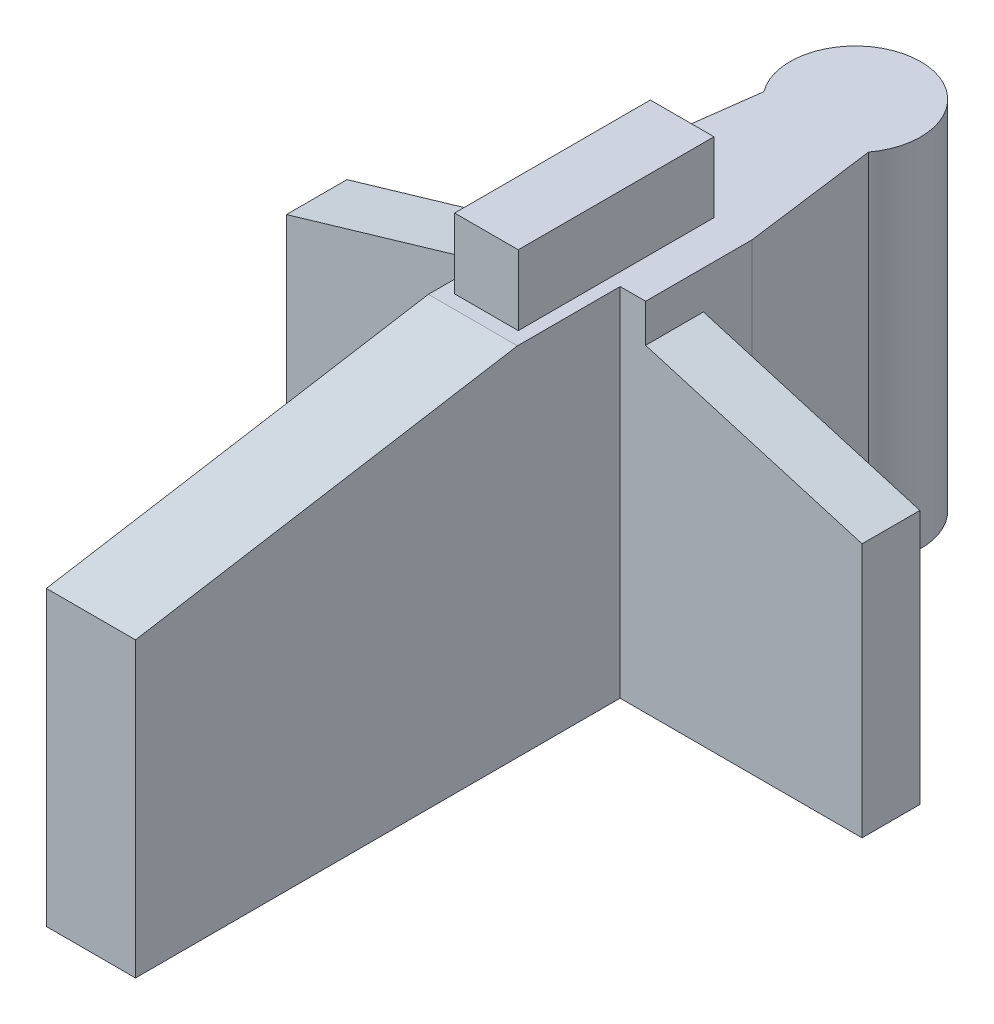
ISO-10303-21;
HEADER;
FILE_DESCRIPTION(('STEP AP214'),'2;1');
FILE_NAME('part.step','',(''),(''),'','','');
FILE_SCHEMA(('AUTOMOTIVE_DESIGN { 1 0 10303 214 1 1 1 1 }'));
ENDSEC;
DATA;
#1=APPLICATION_CONTEXT('core data for automotive mechanical design processes');
#2=APPLICATION_PROTOCOL_DEFINITION('international standard','automotive_design',2000,#1);
#3=PRODUCT_CONTEXT('',#1,'mechanical');
#4=PRODUCT('Part','Part','',(#3));
#5=PRODUCT_RELATED_PRODUCT_CATEGORY('part','',(#4));
#6=PRODUCT_DEFINITION_FORMATION('','',#4);
#7=PRODUCT_DEFINITION_CONTEXT('part definition',#1,'design');
#8=PRODUCT_DEFINITION('design','',#6,#7);
#9=PRODUCT_DEFINITION_SHAPE('','',#8);
#10=(LENGTH_UNIT() NAMED_UNIT(*) SI_UNIT(.MILLI.,.METRE.));
#11=(NAMED_UNIT(*) PLANE_ANGLE_UNIT() SI_UNIT($,.RADIAN.));
#12=(NAMED_UNIT(*) SI_UNIT($,.STERADIAN.) SOLID_ANGLE_UNIT());
#13=UNCERTAINTY_MEASURE_WITH_UNIT(LENGTH_MEASURE(1.E-05),#10,'distance_accuracy_value','');
#14=(GEOMETRIC_REPRESENTATION_CONTEXT(3) GLOBAL_UNCERTAINTY_ASSIGNED_CONTEXT((#13)) GLOBAL_UNIT_ASSIGNED_CONTEXT((#10,
#11,#12)) REPRESENTATION_CONTEXT('',''));
#15=CARTESIAN_POINT('',(0.,0.,0.));
#16=DIRECTION('',(0.,0.,1.));
#17=DIRECTION('',(1.,0.,0.));
#18=AXIS2_PLACEMENT_3D('',#15,#16,#17);
#19=CARTESIAN_POINT('',(-244.663612926223,28.,-686.963208125128));
#20=DIRECTION('',(0.,1.,0.));
#21=DIRECTION('',(0.,0.,1.));
#22=AXIS2_PLACEMENT_3D('',#19,#20,#21);
#23=PLANE('',#22);
#24=DIRECTION('',(-1.,0.,0.));
#25=VECTOR('',#24,1.);
#26=CARTESIAN_POINT('',(-240.163612926223,28.,-656.928572815102));
#27=LINE('',#26,#25);
#28=CARTESIAN_POINT('',(-241.163612926223,28.,-656.928572815102));
#29=VERTEX_POINT('',#28);
#30=CARTESIAN_POINT('',(-248.163612926223,28.,-656.928572815102));
#31=VERTEX_POINT('',#30);
#32=EDGE_CURVE('E185',#29,#31,#27,.T.);
#33=ORIENTED_EDGE('',*,*,#32,.F.);
#34=DIRECTION('',(0.,0.,-1.));
#35=VECTOR('',#34,1.);
#36=CARTESIAN_POINT('',(-241.163612926223,28.,-664.99033886544));
#37=LINE('',#36,#35);
#38=CARTESIAN_POINT('',(-241.163612926223,28.,-664.99033886544));
#39=VERTEX_POINT('',#38);
#40=EDGE_CURVE('E206',#29,#39,#37,.T.);
#41=ORIENTED_EDGE('',*,*,#40,.T.);
#42=DIRECTION('',(1.,0.,0.));
#43=VECTOR('',#42,1.);
#44=CARTESIAN_POINT('',(-241.163612926223,28.,-664.99033886544));
#45=LINE('',#44,#43);
#46=CARTESIAN_POINT('',(-239.163612926223,28.,-664.99033886544));
#47=VERTEX_POINT('',#46);
#48=EDGE_CURVE('E208',#39,#47,#45,.T.);
#49=ORIENTED_EDGE('',*,*,#48,.T.);
#50=DIRECTION('',(0.,0.,-1.));
#51=VECTOR('',#50,1.);
#52=CARTESIAN_POINT('',(-239.163612926223,28.,-669.533367529978));
#53=LINE('',#52,#51);
#54=CARTESIAN_POINT('',(-239.163612926223,28.,-673.362411263052));
#55=VERTEX_POINT('',#54);
#56=EDGE_CURVE('E216',#47,#55,#53,.T.);
#57=ORIENTED_EDGE('',*,*,#56,.T.);
#58=DIRECTION('',(-0.131042864978356,0.,-0.991376703144806));
#59=VECTOR('',#58,1.);
#60=CARTESIAN_POINT('',(-240.555238769511,28.,-683.890458255598));
#61=LINE('',#60,#59);
#62=CARTESIAN_POINT('',(-240.555238769511,28.,-683.890458255598));
#63=VERTEX_POINT('',#62);
#64=EDGE_CURVE('E218',#55,#63,#61,.T.);
#65=ORIENTED_EDGE('',*,*,#64,.T.);
#66=CARTESIAN_POINT('',(-244.663612926223,28.,-686.963208125128));
#67=DIRECTION('',(0.,1.,0.));
#68=DIRECTION('',(0.,0.,1.));
#69=AXIS2_PLACEMENT_3D('',#66,#67,#68);
#70=CIRCLE('',#69,5.13035378626444);
#71=CARTESIAN_POINT('',(-248.771987082935,28.,-683.890458255598));
#72=VERTEX_POINT('',#71);
#73=EDGE_CURVE('E258',#63,#72,#70,.T.);
#74=ORIENTED_EDGE('',*,*,#73,.T.);
#75=DIRECTION('',(-0.131054564296495,0.,0.991375156626923));
#76=VECTOR('',#75,1.);
#77=CARTESIAN_POINT('',(-248.771987082935,28.,-683.890458255598));
#78=LINE('',#77,#76);
#79=CARTESIAN_POINT('',(-250.163612926223,28.,-673.363367529978));
#80=VERTEX_POINT('',#79);
#81=EDGE_CURVE('E365',#72,#80,#78,.T.);
#82=ORIENTED_EDGE('',*,*,#81,.T.);
#83=DIRECTION('',(0.,0.,1.));
#84=VECTOR('',#83,1.);
#85=CARTESIAN_POINT('',(-250.163612926223,28.,-669.533367529978));
#86=LINE('',#85,#84);
#87=CARTESIAN_POINT('',(-250.163612926223,28.,-664.783367529978));
#88=VERTEX_POINT('',#87);
#89=EDGE_CURVE('E210',#80,#88,#86,.T.);
#90=ORIENTED_EDGE('',*,*,#89,.T.);
#91=DIRECTION('',(1.,0.,0.));
#92=VECTOR('',#91,1.);
#93=CARTESIAN_POINT('',(-267.163612926223,28.,-664.783367529978));
#94=LINE('',#93,#92);
#95=CARTESIAN_POINT('',(-248.163612926223,28.,-664.783367529978));
#96=VERTEX_POINT('',#95);
#97=EDGE_CURVE('E204',#88,#96,#94,.T.);
#98=ORIENTED_EDGE('',*,*,#97,.T.);
#99=DIRECTION('',(0.,0.,1.));
#100=VECTOR('',#99,1.);
#101=CARTESIAN_POINT('',(-248.163612926223,28.,-626.928572815102));
#102=LINE('',#101,#100);
#103=EDGE_CURVE('E198',#96,#31,#102,.T.);
#104=ORIENTED_EDGE('',*,*,#103,.T.);
#105=EDGE_LOOP('',(#33,#41,#49,#57,#65,#74,#82,#90,#98,#104));
#106=FACE_BOUND('',#105,.T.);
#107=DIRECTION('',(-1.,0.,0.));
#108=VECTOR('',#107,1.);
#109=CARTESIAN_POINT('',(-244.663612926223,28.,-673.363106729907));
#110=LINE('',#109,#108);
#111=CARTESIAN_POINT('',(-244.663612926223,28.,-673.363106729907));
#112=VERTEX_POINT('',#111);
#113=CARTESIAN_POINT('',(-247.163612926223,28.,-673.363106729907));
#114=VERTEX_POINT('',#113);
#115=EDGE_CURVE('E339',#112,#114,#110,.T.);
#116=ORIENTED_EDGE('',*,*,#115,.F.);
#117=DIRECTION('',(0.,0.,-1.));
#118=VECTOR('',#117,1.);
#119=CARTESIAN_POINT('',(-244.663612926223,28.,-673.362889396515));
#120=LINE('',#119,#118);
#121=CARTESIAN_POINT('',(-244.663612926223,28.,-673.362889396515));
#122=VERTEX_POINT('',#121);
#123=EDGE_CURVE('E321',#122,#112,#120,.T.);
#124=ORIENTED_EDGE('',*,*,#123,.F.);
#125=DIRECTION('',(-1.,0.,0.));
#126=VECTOR('',#125,1.);
#127=CARTESIAN_POINT('',(-244.663612926223,28.,-673.362889396515));
#128=LINE('',#127,#126);
#129=CARTESIAN_POINT('',(-242.163612926223,28.,-673.362889396515));
#130=VERTEX_POINT('',#129);
#131=EDGE_CURVE('E326',#130,#122,#128,.T.);
#132=ORIENTED_EDGE('',*,*,#131,.F.);
#133=DIRECTION('',(0.,0.,-1.));
#134=VECTOR('',#133,1.);
#135=CARTESIAN_POINT('',(-242.163612926223,28.,-673.362889396515));
#136=LINE('',#135,#134);
#137=CARTESIAN_POINT('',(-242.163612926223,28.,-657.99033886544));
#138=VERTEX_POINT('',#137);
#139=EDGE_CURVE('E345',#138,#130,#136,.T.);
#140=ORIENTED_EDGE('',*,*,#139,.F.);
#141=DIRECTION('',(1.,0.,0.));
#142=VECTOR('',#141,1.);
#143=CARTESIAN_POINT('',(-244.663612926223,28.,-657.99033886544));
#144=LINE('',#143,#142);
#145=CARTESIAN_POINT('',(-247.163612926223,28.,-657.99033886544));
#146=VERTEX_POINT('',#145);
#147=EDGE_CURVE('E343',#146,#138,#144,.T.);
#148=ORIENTED_EDGE('',*,*,#147,.F.);
#149=DIRECTION('',(0.,0.,1.));
#150=VECTOR('',#149,1.);
#151=CARTESIAN_POINT('',(-247.163612926223,28.,-657.99033886544));
#152=LINE('',#151,#150);
#153=EDGE_CURVE('E341',#114,#146,#152,.T.);
#154=ORIENTED_EDGE('',*,*,#153,.F.);
#155=EDGE_LOOP('',(#116,#124,#132,#140,#148,#154));
#156=FACE_BOUND('',#155,.T.);
#157=ADVANCED_FACE('F33',(#106,#156),#23,.T.);
#158=CARTESIAN_POINT('',(-244.663612926223,28.,-686.963208125128));
#159=DIRECTION('',(0.,-1.,0.));
#160=DIRECTION('',(0.,0.,-1.));
#161=AXIS2_PLACEMENT_3D('',#158,#159,#160);
#162=CYLINDRICAL_SURFACE('',#161,5.13035378626444);
#163=CARTESIAN_POINT('',(-244.663612926223,0.,-686.963208125128));
#164=DIRECTION('',(0.,1.,0.));
#165=DIRECTION('',(0.,0.,1.));
#166=AXIS2_PLACEMENT_3D('',#163,#164,#165);
#167=CIRCLE('',#166,5.13035378626444);
#168=CARTESIAN_POINT('',(-240.555238769511,0.,-683.890458255598));
#169=VERTEX_POINT('',#168);
#170=CARTESIAN_POINT('',(-248.771987082935,0.,-683.890458255598));
#171=VERTEX_POINT('',#170);
#172=EDGE_CURVE('E221',#169,#171,#167,.T.);
#173=ORIENTED_EDGE('',*,*,#172,.T.);
#174=DIRECTION('',(0.,-1.,0.));
#175=VECTOR('',#174,1.);
#176=CARTESIAN_POINT('',(-248.771987082935,28.,-683.890458255598));
#177=LINE('',#176,#175);
#178=EDGE_CURVE('E287',#72,#171,#177,.T.);
#179=ORIENTED_EDGE('',*,*,#178,.F.);
#180=ORIENTED_EDGE('',*,*,#73,.F.);
#181=DIRECTION('',(0.,-1.,0.));
#182=VECTOR('',#181,1.);
#183=CARTESIAN_POINT('',(-240.555238769511,28.,-683.890458255598));
#184=LINE('',#183,#182);
#185=EDGE_CURVE('E220',#63,#169,#184,.T.);
#186=ORIENTED_EDGE('',*,*,#185,.T.);
#187=EDGE_LOOP('',(#173,#179,#180,#186));
#188=FACE_BOUND('',#187,.T.);
#189=ADVANCED_FACE('F35',(#188),#162,.T.);
#190=CARTESIAN_POINT('',(-248.771987082935,28.,-683.890458255598));
#191=DIRECTION('',(0.991375156626923,0.,0.131054564296495));
#192=DIRECTION('',(0.131054564296495,0.,-0.991375156626923));
#193=AXIS2_PLACEMENT_3D('',#190,#191,#192);
#194=PLANE('',#193);
#195=DIRECTION('',(-0.131054564296495,0.,0.991375156626923));
#196=VECTOR('',#195,1.);
#197=CARTESIAN_POINT('',(-248.771987082935,0.,-683.890458255598));
#198=LINE('',#197,#196);
#199=CARTESIAN_POINT('',(-250.163612926223,0.,-673.363367529978));
#200=VERTEX_POINT('',#199);
#201=EDGE_CURVE('E224',#171,#200,#198,.T.);
#202=ORIENTED_EDGE('',*,*,#201,.T.);
#203=DIRECTION('',(0.,-1.,0.));
#204=VECTOR('',#203,1.);
#205=CARTESIAN_POINT('',(-250.163612926223,28.,-673.363367529978));
#206=LINE('',#205,#204);
#207=EDGE_CURVE('E284',#80,#200,#206,.T.);
#208=ORIENTED_EDGE('',*,*,#207,.F.);
#209=ORIENTED_EDGE('',*,*,#81,.F.);
#210=ORIENTED_EDGE('',*,*,#178,.T.);
#211=EDGE_LOOP('',(#202,#208,#209,#210));
#212=FACE_BOUND('',#211,.T.);
#213=ADVANCED_FACE('F370',(#212),#194,.F.);
#214=CARTESIAN_POINT('',(-250.163612926223,28.,-669.533367529978));
#215=DIRECTION('',(1.,0.,0.));
#216=DIRECTION('',(0.,0.,-1.));
#217=AXIS2_PLACEMENT_3D('',#214,#215,#216);
#218=PLANE('',#217);
#219=DIRECTION('',(0.,0.,1.));
#220=VECTOR('',#219,1.);
#221=CARTESIAN_POINT('',(-250.163612926223,0.,-669.533367529978));
#222=LINE('',#221,#220);
#223=CARTESIAN_POINT('',(-250.163612926223,0.,-669.533367529978));
#224=VERTEX_POINT('',#223);
#225=EDGE_CURVE('E227',#200,#224,#222,.T.);
#226=ORIENTED_EDGE('',*,*,#225,.T.);
#227=DIRECTION('',(0.,-1.,0.));
#228=VECTOR('',#227,1.);
#229=CARTESIAN_POINT('',(-250.163612926223,28.,-669.533367529978));
#230=LINE('',#229,#228);
#231=CARTESIAN_POINT('',(-250.163612926223,25.,-669.533367529978));
#232=VERTEX_POINT('',#231);
#233=EDGE_CURVE('E282',#232,#224,#230,.T.);
#234=ORIENTED_EDGE('',*,*,#233,.F.);
#235=DIRECTION('',(0.,0.,-1.));
#236=VECTOR('',#235,1.);
#237=CARTESIAN_POINT('',(-250.163612926223,25.,-664.033367529978));
#238=LINE('',#237,#236);
#239=CARTESIAN_POINT('',(-250.163612926223,25.,-664.783367529978));
#240=VERTEX_POINT('',#239);
#241=EDGE_CURVE('E301',#240,#232,#238,.T.);
#242=ORIENTED_EDGE('',*,*,#241,.F.);
#243=DIRECTION('',(0.,-1.,0.));
#244=VECTOR('',#243,1.);
#245=CARTESIAN_POINT('',(-250.163612926223,28.,-664.783367529978));
#246=LINE('',#245,#244);
#247=EDGE_CURVE('E41',#88,#240,#246,.T.);
#248=ORIENTED_EDGE('',*,*,#247,.F.);
#249=ORIENTED_EDGE('',*,*,#89,.F.);
#250=ORIENTED_EDGE('',*,*,#207,.T.);
#251=EDGE_LOOP('',(#226,#234,#242,#248,#249,#250));
#252=FACE_BOUND('',#251,.T.);
#253=ADVANCED_FACE('F299',(#252),#218,.F.);
#254=CARTESIAN_POINT('',(-267.163612926223,28.,-669.533367529978));
#255=DIRECTION('',(0.,0.,1.));
#256=DIRECTION('',(1.,0.,0.));
#257=AXIS2_PLACEMENT_3D('',#254,#255,#256);
#258=PLANE('',#257);
#259=DIRECTION('',(0.,-1.,0.));
#260=VECTOR('',#259,1.);
#261=CARTESIAN_POINT('',(-267.163612926223,28.,-669.533367529978));
#262=LINE('',#261,#260);
#263=CARTESIAN_POINT('',(-267.163612926223,20.,-669.533367529978));
#264=VERTEX_POINT('',#263);
#265=CARTESIAN_POINT('',(-267.163612926223,0.,-669.533367529978));
#266=VERTEX_POINT('',#265);
#267=EDGE_CURVE('E280',#264,#266,#262,.T.);
#268=ORIENTED_EDGE('',*,*,#267,.F.);
#269=DIRECTION('',(-0.959365501571271,-0.28216632399155,0.));
#270=VECTOR('',#269,1.);
#271=CARTESIAN_POINT('',(-267.163612926223,20.,-669.533367529978));
#272=LINE('',#271,#270);
#273=EDGE_CURVE('E303',#232,#264,#272,.T.);
#274=ORIENTED_EDGE('',*,*,#273,.F.);
#275=ORIENTED_EDGE('',*,*,#233,.T.);
#276=DIRECTION('',(-1.,0.,0.));
#277=VECTOR('',#276,1.);
#278=CARTESIAN_POINT('',(-267.163612926223,0.,-669.533367529978));
#279=LINE('',#278,#277);
#280=EDGE_CURVE('E230',#224,#266,#279,.T.);
#281=ORIENTED_EDGE('',*,*,#280,.T.);
#282=EDGE_LOOP('',(#268,#274,#275,#281));
#283=FACE_BOUND('',#282,.T.);
#284=ADVANCED_FACE('F380',(#283),#258,.F.);
#285=CARTESIAN_POINT('',(-267.163612926223,28.,-669.533367529978));
#286=DIRECTION('',(1.,0.,0.));
#287=DIRECTION('',(0.,0.,-1.));
#288=AXIS2_PLACEMENT_3D('',#285,#286,#287);
#289=PLANE('',#288);
#290=DIRECTION('',(0.,-1.,0.));
#291=VECTOR('',#290,1.);
#292=CARTESIAN_POINT('',(-267.163612926223,28.,-664.783367529978));
#293=LINE('',#292,#291);
#294=CARTESIAN_POINT('',(-267.163612926223,20.,-664.783367529978));
#295=VERTEX_POINT('',#294);
#296=CARTESIAN_POINT('',(-267.163612926223,0.,-664.783367529978));
#297=VERTEX_POINT('',#296);
#298=EDGE_CURVE('E278',#295,#297,#293,.T.);
#299=ORIENTED_EDGE('',*,*,#298,.F.);
#300=DIRECTION('',(0.,0.,-1.));
#301=VECTOR('',#300,1.);
#302=CARTESIAN_POINT('',(-267.163612926223,20.,-664.033367529978));
#303=LINE('',#302,#301);
#304=EDGE_CURVE('E55',#295,#264,#303,.T.);
#305=ORIENTED_EDGE('',*,*,#304,.T.);
#306=ORIENTED_EDGE('',*,*,#267,.T.);
#307=DIRECTION('',(0.,0.,1.));
#308=VECTOR('',#307,1.);
#309=CARTESIAN_POINT('',(-267.163612926223,0.,-669.533367529978));
#310=LINE('',#309,#308);
#311=EDGE_CURVE('E233',#266,#297,#310,.T.);
#312=ORIENTED_EDGE('',*,*,#311,.T.);
#313=EDGE_LOOP('',(#299,#305,#306,#312));
#314=FACE_BOUND('',#313,.T.);
#315=ADVANCED_FACE('F383',(#314),#289,.F.);
#316=CARTESIAN_POINT('',(-267.163612926223,28.,-664.783367529978));
#317=DIRECTION('',(0.,0.,-1.));
#318=DIRECTION('',(-1.,0.,0.));
#319=AXIS2_PLACEMENT_3D('',#316,#317,#318);
#320=PLANE('',#319);
#321=ORIENTED_EDGE('',*,*,#97,.F.);
#322=ORIENTED_EDGE('',*,*,#247,.T.);
#323=DIRECTION('',(-0.959365501571271,-0.28216632399155,0.));
#324=VECTOR('',#323,1.);
#325=CARTESIAN_POINT('',(-264.998007830682,20.6369426751592,-664.783367529978));
#326=LINE('',#325,#324);
#327=EDGE_CURVE('E290',#240,#295,#326,.T.);
#328=ORIENTED_EDGE('',*,*,#327,.T.);
#329=ORIENTED_EDGE('',*,*,#298,.T.);
#330=DIRECTION('',(1.,0.,0.));
#331=VECTOR('',#330,1.);
#332=CARTESIAN_POINT('',(-267.163612926223,0.,-664.783367529978));
#333=LINE('',#332,#331);
#334=CARTESIAN_POINT('',(-248.163612926223,0.,-664.783367529978));
#335=VERTEX_POINT('',#334);
#336=EDGE_CURVE('E236',#297,#335,#333,.T.);
#337=ORIENTED_EDGE('',*,*,#336,.T.);
#338=DIRECTION('',(0.,-1.,0.));
#339=VECTOR('',#338,1.);
#340=CARTESIAN_POINT('',(-248.163612926223,28.,-664.783367529978));
#341=LINE('',#340,#339);
#342=EDGE_CURVE('E276',#96,#335,#341,.T.);
#343=ORIENTED_EDGE('',*,*,#342,.F.);
#344=EDGE_LOOP('',(#321,#322,#328,#329,#337,#343));
#345=FACE_BOUND('',#344,.T.);
#346=ADVANCED_FACE('F294',(#345),#320,.F.);
#347=CARTESIAN_POINT('',(-248.163612926223,28.,-626.928572815102));
#348=DIRECTION('',(1.,0.,0.));
#349=DIRECTION('',(0.,0.,-1.));
#350=AXIS2_PLACEMENT_3D('',#347,#348,#349);
#351=PLANE('',#350);
#352=DIRECTION('',(0.,-1.,0.));
#353=VECTOR('',#352,1.);
#354=CARTESIAN_POINT('',(-248.163612926223,28.,-626.928572815102));
#355=LINE('',#354,#353);
#356=CARTESIAN_POINT('',(-248.163612926223,23.,-626.928572815102));
#357=VERTEX_POINT('',#356);
#358=CARTESIAN_POINT('',(-248.163612926223,0.,-626.928572815102));
#359=VERTEX_POINT('',#358);
#360=EDGE_CURVE('E200',#357,#359,#355,.T.);
#361=ORIENTED_EDGE('',*,*,#360,.F.);
#362=DIRECTION('',(0.,-0.164398987305357,0.986393923832144));
#363=VECTOR('',#362,1.);
#364=CARTESIAN_POINT('',(-248.163612926223,23.,-626.928572815102));
#365=LINE('',#364,#363);
#366=EDGE_CURVE('E188',#31,#357,#365,.T.);
#367=ORIENTED_EDGE('',*,*,#366,.F.);
#368=ORIENTED_EDGE('',*,*,#103,.F.);
#369=ORIENTED_EDGE('',*,*,#342,.T.);
#370=DIRECTION('',(0.,0.,1.));
#371=VECTOR('',#370,1.);
#372=CARTESIAN_POINT('',(-248.163612926223,0.,-626.928572815102));
#373=LINE('',#372,#371);
#374=EDGE_CURVE('E238',#335,#359,#373,.T.);
#375=ORIENTED_EDGE('',*,*,#374,.T.);
#376=EDGE_LOOP('',(#361,#367,#368,#369,#375));
#377=FACE_BOUND('',#376,.T.);
#378=ADVANCED_FACE('F196',(#377),#351,.F.);
#379=CARTESIAN_POINT('',(-244.663612926223,28.,-626.928572815102));
#380=DIRECTION('',(0.,0.,-1.));
#381=DIRECTION('',(-1.,0.,0.));
#382=AXIS2_PLACEMENT_3D('',#379,#380,#381);
#383=PLANE('',#382);
#384=DIRECTION('',(0.,-1.,0.));
#385=VECTOR('',#384,1.);
#386=CARTESIAN_POINT('',(-241.163612926223,28.,-626.928572815102));
#387=LINE('',#386,#385);
#388=CARTESIAN_POINT('',(-241.163612926223,23.,-626.928572815102));
#389=VERTEX_POINT('',#388);
#390=CARTESIAN_POINT('',(-241.163612926223,0.,-626.928572815102));
#391=VERTEX_POINT('',#390);
#392=EDGE_CURVE('E273',#389,#391,#387,.T.);
#393=ORIENTED_EDGE('',*,*,#392,.F.);
#394=DIRECTION('',(-1.,0.,0.));
#395=VECTOR('',#394,1.);
#396=CARTESIAN_POINT('',(-240.163612926223,23.,-626.928572815102));
#397=LINE('',#396,#395);
#398=EDGE_CURVE('E48',#389,#357,#397,.T.);
#399=ORIENTED_EDGE('',*,*,#398,.T.);
#400=ORIENTED_EDGE('',*,*,#360,.T.);
#401=DIRECTION('',(1.,0.,0.));
#402=VECTOR('',#401,1.);
#403=CARTESIAN_POINT('',(-244.663612926223,0.,-626.928572815102));
#404=LINE('',#403,#402);
#405=EDGE_CURVE('E240',#359,#391,#404,.T.);
#406=ORIENTED_EDGE('',*,*,#405,.T.);
#407=EDGE_LOOP('',(#393,#399,#400,#406));
#408=FACE_BOUND('',#407,.T.);
#409=ADVANCED_FACE('F390',(#408),#383,.F.);
#410=CARTESIAN_POINT('',(-241.163612926223,28.,-664.99033886544));
#411=DIRECTION('',(-1.,0.,0.));
#412=DIRECTION('',(0.,0.,1.));
#413=AXIS2_PLACEMENT_3D('',#410,#411,#412);
#414=PLANE('',#413);
#415=ORIENTED_EDGE('',*,*,#40,.F.);
#416=DIRECTION('',(0.,-0.164398987305357,0.986393923832144));
#417=VECTOR('',#416,1.);
#418=CARTESIAN_POINT('',(-241.163612926223,29.3073134135683,-664.772453296512));
#419=LINE('',#418,#417);
#420=EDGE_CURVE('E11',#29,#389,#419,.T.);
#421=ORIENTED_EDGE('',*,*,#420,.T.);
#422=ORIENTED_EDGE('',*,*,#392,.T.);
#423=DIRECTION('',(0.,0.,-1.));
#424=VECTOR('',#423,1.);
#425=CARTESIAN_POINT('',(-241.163612926223,0.,-664.99033886544));
#426=LINE('',#425,#424);
#427=CARTESIAN_POINT('',(-241.163612926223,0.,-664.99033886544));
#428=VERTEX_POINT('',#427);
#429=EDGE_CURVE('E243',#391,#428,#426,.T.);
#430=ORIENTED_EDGE('',*,*,#429,.T.);
#431=DIRECTION('',(0.,-1.,0.));
#432=VECTOR('',#431,1.);
#433=CARTESIAN_POINT('',(-241.163612926223,28.,-664.99033886544));
#434=LINE('',#433,#432);
#435=EDGE_CURVE('E270',#39,#428,#434,.T.);
#436=ORIENTED_EDGE('',*,*,#435,.F.);
#437=EDGE_LOOP('',(#415,#421,#422,#430,#436));
#438=FACE_BOUND('',#437,.T.);
#439=ADVANCED_FACE('F393',(#438),#414,.F.);
#440=CARTESIAN_POINT('',(-241.163612926223,28.,-664.99033886544));
#441=DIRECTION('',(0.,0.,-1.));
#442=DIRECTION('',(-1.,0.,0.));
#443=AXIS2_PLACEMENT_3D('',#440,#441,#442);
#444=PLANE('',#443);
#445=DIRECTION('',(-0.959365501571271,0.28216632399155,0.));
#446=VECTOR('',#445,1.);
#447=CARTESIAN_POINT('',(-241.816479168261,25.7802547770701,-664.99033886544));
#448=LINE('',#447,#446);
#449=CARTESIAN_POINT('',(-222.163612926223,20.,-664.99033886544));
#450=VERTEX_POINT('',#449);
#451=CARTESIAN_POINT('',(-239.163612926223,25.,-664.99033886544));
#452=VERTEX_POINT('',#451);
#453=EDGE_CURVE('E314',#450,#452,#448,.T.);
#454=ORIENTED_EDGE('',*,*,#453,.T.);
#455=DIRECTION('',(0.,1.,0.));
#456=VECTOR('',#455,1.);
#457=CARTESIAN_POINT('',(-239.163612926223,28.,-664.99033886544));
#458=LINE('',#457,#456);
#459=EDGE_CURVE('E318',#452,#47,#458,.T.);
#460=ORIENTED_EDGE('',*,*,#459,.T.);
#461=ORIENTED_EDGE('',*,*,#48,.F.);
#462=ORIENTED_EDGE('',*,*,#435,.T.);
#463=DIRECTION('',(1.,0.,0.));
#464=VECTOR('',#463,1.);
#465=CARTESIAN_POINT('',(-241.163612926223,0.,-664.99033886544));
#466=LINE('',#465,#464);
#467=CARTESIAN_POINT('',(-222.163612926223,0.,-664.99033886544));
#468=VERTEX_POINT('',#467);
#469=EDGE_CURVE('E245',#428,#468,#466,.T.);
#470=ORIENTED_EDGE('',*,*,#469,.T.);
#471=DIRECTION('',(0.,-1.,0.));
#472=VECTOR('',#471,1.);
#473=CARTESIAN_POINT('',(-222.163612926223,28.,-664.99033886544));
#474=LINE('',#473,#472);
#475=EDGE_CURVE('E268',#450,#468,#474,.T.);
#476=ORIENTED_EDGE('',*,*,#475,.F.);
#477=EDGE_LOOP('',(#454,#460,#461,#462,#470,#476));
#478=FACE_BOUND('',#477,.T.);
#479=ADVANCED_FACE('F398',(#478),#444,.F.);
#480=CARTESIAN_POINT('',(-222.163612926223,28.,-669.533367529978));
#481=DIRECTION('',(-1.,0.,0.));
#482=DIRECTION('',(0.,0.,1.));
#483=AXIS2_PLACEMENT_3D('',#480,#481,#482);
#484=PLANE('',#483);
#485=DIRECTION('',(0.,-1.,0.));
#486=VECTOR('',#485,1.);
#487=CARTESIAN_POINT('',(-222.163612926223,28.,-669.533367529978));
#488=LINE('',#487,#486);
#489=CARTESIAN_POINT('',(-222.163612926223,20.,-669.533367529978));
#490=VERTEX_POINT('',#489);
#491=CARTESIAN_POINT('',(-222.163612926223,0.,-669.533367529978));
#492=VERTEX_POINT('',#491);
#493=EDGE_CURVE('E266',#490,#492,#488,.T.);
#494=ORIENTED_EDGE('',*,*,#493,.F.);
#495=DIRECTION('',(0.,0.,-1.));
#496=VECTOR('',#495,1.);
#497=CARTESIAN_POINT('',(-222.163612926223,20.,-664.033367529978));
#498=LINE('',#497,#496);
#499=EDGE_CURVE('E310',#450,#490,#498,.T.);
#500=ORIENTED_EDGE('',*,*,#499,.F.);
#501=ORIENTED_EDGE('',*,*,#475,.T.);
#502=DIRECTION('',(0.,0.,-1.));
#503=VECTOR('',#502,1.);
#504=CARTESIAN_POINT('',(-222.163612926223,0.,-669.533367529978));
#505=LINE('',#504,#503);
#506=EDGE_CURVE('E248',#468,#492,#505,.T.);
#507=ORIENTED_EDGE('',*,*,#506,.T.);
#508=EDGE_LOOP('',(#494,#500,#501,#507));
#509=FACE_BOUND('',#508,.T.);
#510=ADVANCED_FACE('F412',(#509),#484,.F.);
#511=CARTESIAN_POINT('',(-239.163612926223,28.,-669.533367529978));
#512=DIRECTION('',(0.,0.,1.));
#513=DIRECTION('',(1.,0.,0.));
#514=AXIS2_PLACEMENT_3D('',#511,#512,#513);
#515=PLANE('',#514);
#516=DIRECTION('',(0.,-1.,0.));
#517=VECTOR('',#516,1.);
#518=CARTESIAN_POINT('',(-239.163612926223,28.,-669.533367529978));
#519=LINE('',#518,#517);
#520=CARTESIAN_POINT('',(-239.163612926223,25.,-669.533367529978));
#521=VERTEX_POINT('',#520);
#522=CARTESIAN_POINT('',(-239.163612926223,0.,-669.533367529978));
#523=VERTEX_POINT('',#522);
#524=EDGE_CURVE('E264',#521,#523,#519,.T.);
#525=ORIENTED_EDGE('',*,*,#524,.F.);
#526=DIRECTION('',(-0.959365501571271,0.28216632399155,0.));
#527=VECTOR('',#526,1.);
#528=CARTESIAN_POINT('',(-222.163612926223,20.,-669.533367529978));
#529=LINE('',#528,#527);
#530=EDGE_CURVE('E305',#490,#521,#529,.T.);
#531=ORIENTED_EDGE('',*,*,#530,.F.);
#532=ORIENTED_EDGE('',*,*,#493,.T.);
#533=DIRECTION('',(-1.,0.,0.));
#534=VECTOR('',#533,1.);
#535=CARTESIAN_POINT('',(-239.163612926223,0.,-669.533367529978));
#536=LINE('',#535,#534);
#537=EDGE_CURVE('E251',#492,#523,#536,.T.);
#538=ORIENTED_EDGE('',*,*,#537,.T.);
#539=EDGE_LOOP('',(#525,#531,#532,#538));
#540=FACE_BOUND('',#539,.T.);
#541=ADVANCED_FACE('F410',(#540),#515,.F.);
#542=CARTESIAN_POINT('',(-239.163612926223,28.,-669.533367529978));
#543=DIRECTION('',(-1.,0.,0.));
#544=DIRECTION('',(0.,0.,1.));
#545=AXIS2_PLACEMENT_3D('',#542,#543,#544);
#546=PLANE('',#545);
#547=DIRECTION('',(0.,0.,-1.));
#548=VECTOR('',#547,1.);
#549=CARTESIAN_POINT('',(-239.163612926223,0.,-669.533367529978));
#550=LINE('',#549,#548);
#551=CARTESIAN_POINT('',(-239.163612926223,0.,-673.362411263052));
#552=VERTEX_POINT('',#551);
#553=EDGE_CURVE('E254',#523,#552,#550,.T.);
#554=ORIENTED_EDGE('',*,*,#553,.T.);
#555=DIRECTION('',(0.,-1.,0.));
#556=VECTOR('',#555,1.);
#557=CARTESIAN_POINT('',(-239.163612926223,28.,-673.362411263052));
#558=LINE('',#557,#556);
#559=EDGE_CURVE('E261',#55,#552,#558,.T.);
#560=ORIENTED_EDGE('',*,*,#559,.F.);
#561=ORIENTED_EDGE('',*,*,#56,.F.);
#562=ORIENTED_EDGE('',*,*,#459,.F.);
#563=DIRECTION('',(0.,0.,-1.));
#564=VECTOR('',#563,1.);
#565=CARTESIAN_POINT('',(-239.163612926223,25.,-664.033367529978));
#566=LINE('',#565,#564);
#567=EDGE_CURVE('E311',#452,#521,#566,.T.);
#568=ORIENTED_EDGE('',*,*,#567,.T.);
#569=ORIENTED_EDGE('',*,*,#524,.T.);
#570=EDGE_LOOP('',(#554,#560,#561,#562,#568,#569));
#571=FACE_BOUND('',#570,.T.);
#572=ADVANCED_FACE('F402',(#571),#546,.F.);
#573=CARTESIAN_POINT('',(-240.555238769511,28.,-683.890458255598));
#574=DIRECTION('',(-0.991376703144806,0.,0.131042864978356));
#575=DIRECTION('',(0.131042864978356,0.,0.991376703144806));
#576=AXIS2_PLACEMENT_3D('',#573,#574,#575);
#577=PLANE('',#576);
#578=DIRECTION('',(-0.131042864978356,0.,-0.991376703144806));
#579=VECTOR('',#578,1.);
#580=CARTESIAN_POINT('',(-240.555238769511,0.,-683.890458255598));
#581=LINE('',#580,#579);
#582=EDGE_CURVE('E256',#552,#169,#581,.T.);
#583=ORIENTED_EDGE('',*,*,#582,.T.);
#584=ORIENTED_EDGE('',*,*,#185,.F.);
#585=ORIENTED_EDGE('',*,*,#64,.F.);
#586=ORIENTED_EDGE('',*,*,#559,.T.);
#587=EDGE_LOOP('',(#583,#584,#585,#586));
#588=FACE_BOUND('',#587,.T.);
#589=ADVANCED_FACE('F419',(#588),#577,.F.);
#590=CARTESIAN_POINT('',(-244.663612926223,0.,-686.963208125128));
#591=DIRECTION('',(0.,1.,0.));
#592=DIRECTION('',(0.,0.,1.));
#593=AXIS2_PLACEMENT_3D('',#590,#591,#592);
#594=PLANE('',#593);
#595=ORIENTED_EDGE('',*,*,#172,.F.);
#596=ORIENTED_EDGE('',*,*,#582,.F.);
#597=ORIENTED_EDGE('',*,*,#553,.F.);
#598=ORIENTED_EDGE('',*,*,#537,.F.);
#599=ORIENTED_EDGE('',*,*,#506,.F.);
#600=ORIENTED_EDGE('',*,*,#469,.F.);
#601=ORIENTED_EDGE('',*,*,#429,.F.);
#602=ORIENTED_EDGE('',*,*,#405,.F.);
#603=ORIENTED_EDGE('',*,*,#374,.F.);
#604=ORIENTED_EDGE('',*,*,#336,.F.);
#605=ORIENTED_EDGE('',*,*,#311,.F.);
#606=ORIENTED_EDGE('',*,*,#280,.F.);
#607=ORIENTED_EDGE('',*,*,#225,.F.);
#608=ORIENTED_EDGE('',*,*,#201,.F.);
#609=EDGE_LOOP('',(#595,#596,#597,#598,#599,#600,#601,#602,#603,#604,#605,#606,#607,#608));
#610=FACE_BOUND('',#609,.T.);
#611=ADVANCED_FACE('F375',(#610),#594,.F.);
#612=CARTESIAN_POINT('',(-244.663612926223,33.5,-673.362889396515));
#613=DIRECTION('',(-1.,0.,0.));
#614=DIRECTION('',(0.,0.,1.));
#615=AXIS2_PLACEMENT_3D('',#612,#613,#614);
#616=PLANE('',#615);
#617=ORIENTED_EDGE('',*,*,#123,.T.);
#618=DIRECTION('',(0.,-1.,0.));
#619=VECTOR('',#618,1.);
#620=CARTESIAN_POINT('',(-244.663612926223,33.5,-673.363106729907));
#621=LINE('',#620,#619);
#622=CARTESIAN_POINT('',(-244.663612926223,33.5,-673.363106729907));
#623=VERTEX_POINT('',#622);
#624=EDGE_CURVE('E225',#623,#112,#621,.T.);
#625=ORIENTED_EDGE('',*,*,#624,.F.);
#626=DIRECTION('',(0.,0.,-1.));
#627=VECTOR('',#626,1.);
#628=CARTESIAN_POINT('',(-244.663612926223,33.5,-673.362889396515));
#629=LINE('',#628,#627);
#630=CARTESIAN_POINT('',(-244.663612926223,33.5,-673.362889396515));
#631=VERTEX_POINT('',#630);
#632=EDGE_CURVE('E322',#631,#623,#629,.T.);
#633=ORIENTED_EDGE('',*,*,#632,.F.);
#634=DIRECTION('',(0.,-1.,0.));
#635=VECTOR('',#634,1.);
#636=CARTESIAN_POINT('',(-244.663612926223,33.5,-673.362889396515));
#637=LINE('',#636,#635);
#638=EDGE_CURVE('E336',#631,#122,#637,.T.);
#639=ORIENTED_EDGE('',*,*,#638,.T.);
#640=EDGE_LOOP('',(#617,#625,#633,#639));
#641=FACE_BOUND('',#640,.T.);
#642=ADVANCED_FACE('F432',(#641),#616,.F.);
#643=CARTESIAN_POINT('',(-244.663612926223,33.5,-673.363106729907));
#644=DIRECTION('',(0.,0.,1.));
#645=DIRECTION('',(1.,0.,0.));
#646=AXIS2_PLACEMENT_3D('',#643,#644,#645);
#647=PLANE('',#646);
#648=ORIENTED_EDGE('',*,*,#115,.T.);
#649=DIRECTION('',(0.,-1.,0.));
#650=VECTOR('',#649,1.);
#651=CARTESIAN_POINT('',(-247.163612926223,33.5,-673.363106729907));
#652=LINE('',#651,#650);
#653=CARTESIAN_POINT('',(-247.163612926223,33.5,-673.363106729907));
#654=VERTEX_POINT('',#653);
#655=EDGE_CURVE('E359',#654,#114,#652,.T.);
#656=ORIENTED_EDGE('',*,*,#655,.F.);
#657=DIRECTION('',(-1.,0.,0.));
#658=VECTOR('',#657,1.);
#659=CARTESIAN_POINT('',(-244.663612926223,33.5,-673.363106729907));
#660=LINE('',#659,#658);
#661=EDGE_CURVE('E325',#623,#654,#660,.T.);
#662=ORIENTED_EDGE('',*,*,#661,.F.);
#663=ORIENTED_EDGE('',*,*,#624,.T.);
#664=EDGE_LOOP('',(#648,#656,#662,#663));
#665=FACE_BOUND('',#664,.T.);
#666=ADVANCED_FACE('F520',(#665),#647,.F.);
#667=CARTESIAN_POINT('',(-247.163612926223,33.5,-657.99033886544));
#668=DIRECTION('',(1.,0.,0.));
#669=DIRECTION('',(0.,0.,-1.));
#670=AXIS2_PLACEMENT_3D('',#667,#668,#669);
#671=PLANE('',#670);
#672=ORIENTED_EDGE('',*,*,#153,.T.);
#673=DIRECTION('',(0.,-1.,0.));
#674=VECTOR('',#673,1.);
#675=CARTESIAN_POINT('',(-247.163612926223,33.5,-657.99033886544));
#676=LINE('',#675,#674);
#677=CARTESIAN_POINT('',(-247.163612926223,33.5,-657.99033886544));
#678=VERTEX_POINT('',#677);
#679=EDGE_CURVE('E356',#678,#146,#676,.T.);
#680=ORIENTED_EDGE('',*,*,#679,.F.);
#681=DIRECTION('',(0.,0.,1.));
#682=VECTOR('',#681,1.);
#683=CARTESIAN_POINT('',(-247.163612926223,33.5,-657.99033886544));
#684=LINE('',#683,#682);
#685=EDGE_CURVE('E328',#654,#678,#684,.T.);
#686=ORIENTED_EDGE('',*,*,#685,.F.);
#687=ORIENTED_EDGE('',*,*,#655,.T.);
#688=EDGE_LOOP('',(#672,#680,#686,#687));
#689=FACE_BOUND('',#688,.T.);
#690=ADVANCED_FACE('F527',(#689),#671,.F.);
#691=CARTESIAN_POINT('',(-244.663612926223,33.5,-657.99033886544));
#692=DIRECTION('',(0.,0.,-1.));
#693=DIRECTION('',(-1.,0.,0.));
#694=AXIS2_PLACEMENT_3D('',#691,#692,#693);
#695=PLANE('',#694);
#696=ORIENTED_EDGE('',*,*,#147,.T.);
#697=DIRECTION('',(0.,-1.,0.));
#698=VECTOR('',#697,1.);
#699=CARTESIAN_POINT('',(-242.163612926223,33.5,-657.99033886544));
#700=LINE('',#699,#698);
#701=CARTESIAN_POINT('',(-242.163612926223,33.5,-657.99033886544));
#702=VERTEX_POINT('',#701);
#703=EDGE_CURVE('E353',#702,#138,#700,.T.);
#704=ORIENTED_EDGE('',*,*,#703,.F.);
#705=DIRECTION('',(1.,0.,0.));
#706=VECTOR('',#705,1.);
#707=CARTESIAN_POINT('',(-244.663612926223,33.5,-657.99033886544));
#708=LINE('',#707,#706);
#709=EDGE_CURVE('E330',#678,#702,#708,.T.);
#710=ORIENTED_EDGE('',*,*,#709,.F.);
#711=ORIENTED_EDGE('',*,*,#679,.T.);
#712=EDGE_LOOP('',(#696,#704,#710,#711));
#713=FACE_BOUND('',#712,.T.);
#714=ADVANCED_FACE('F534',(#713),#695,.F.);
#715=CARTESIAN_POINT('',(-242.163612926223,33.5,-673.362889396515));
#716=DIRECTION('',(-1.,0.,0.));
#717=DIRECTION('',(0.,0.,1.));
#718=AXIS2_PLACEMENT_3D('',#715,#716,#717);
#719=PLANE('',#718);
#720=ORIENTED_EDGE('',*,*,#139,.T.);
#721=DIRECTION('',(0.,-1.,0.));
#722=VECTOR('',#721,1.);
#723=CARTESIAN_POINT('',(-242.163612926223,33.5,-673.362889396515));
#724=LINE('',#723,#722);
#725=CARTESIAN_POINT('',(-242.163612926223,33.5,-673.362889396515));
#726=VERTEX_POINT('',#725);
#727=EDGE_CURVE('E351',#726,#130,#724,.T.);
#728=ORIENTED_EDGE('',*,*,#727,.F.);
#729=DIRECTION('',(0.,0.,-1.));
#730=VECTOR('',#729,1.);
#731=CARTESIAN_POINT('',(-242.163612926223,33.5,-673.362889396515));
#732=LINE('',#731,#730);
#733=EDGE_CURVE('E332',#702,#726,#732,.T.);
#734=ORIENTED_EDGE('',*,*,#733,.F.);
#735=ORIENTED_EDGE('',*,*,#703,.T.);
#736=EDGE_LOOP('',(#720,#728,#734,#735));
#737=FACE_BOUND('',#736,.T.);
#738=ADVANCED_FACE('F542',(#737),#719,.F.);
#739=CARTESIAN_POINT('',(-244.663612926223,33.5,-673.362889396515));
#740=DIRECTION('',(0.,0.,1.));
#741=DIRECTION('',(1.,0.,0.));
#742=AXIS2_PLACEMENT_3D('',#739,#740,#741);
#743=PLANE('',#742);
#744=ORIENTED_EDGE('',*,*,#131,.T.);
#745=ORIENTED_EDGE('',*,*,#638,.F.);
#746=DIRECTION('',(-1.,0.,0.));
#747=VECTOR('',#746,1.);
#748=CARTESIAN_POINT('',(-244.663612926223,33.5,-673.362889396515));
#749=LINE('',#748,#747);
#750=EDGE_CURVE('E334',#726,#631,#749,.T.);
#751=ORIENTED_EDGE('',*,*,#750,.F.);
#752=ORIENTED_EDGE('',*,*,#727,.T.);
#753=EDGE_LOOP('',(#744,#745,#751,#752));
#754=FACE_BOUND('',#753,.T.);
#755=ADVANCED_FACE('F550',(#754),#743,.F.);
#756=CARTESIAN_POINT('',(0.,33.5,0.));
#757=DIRECTION('',(0.,1.,0.));
#758=DIRECTION('',(0.,0.,1.));
#759=AXIS2_PLACEMENT_3D('',#756,#757,#758);
#760=PLANE('',#759);
#761=ORIENTED_EDGE('',*,*,#632,.T.);
#762=ORIENTED_EDGE('',*,*,#661,.T.);
#763=ORIENTED_EDGE('',*,*,#685,.T.);
#764=ORIENTED_EDGE('',*,*,#709,.T.);
#765=ORIENTED_EDGE('',*,*,#733,.T.);
#766=ORIENTED_EDGE('',*,*,#750,.T.);
#767=EDGE_LOOP('',(#761,#762,#763,#764,#765,#766));
#768=FACE_BOUND('',#767,.T.);
#769=ADVANCED_FACE('F558',(#768),#760,.T.);
#770=CARTESIAN_POINT('',(-222.163612926223,20.,-664.033367529978));
#771=DIRECTION('',(-0.28216632399155,-0.959365501571271,0.));
#772=DIRECTION('',(0.959365501571271,-0.28216632399155,0.));
#773=AXIS2_PLACEMENT_3D('',#770,#771,#772);
#774=PLANE('',#773);
#775=ORIENTED_EDGE('',*,*,#499,.T.);
#776=ORIENTED_EDGE('',*,*,#530,.T.);
#777=ORIENTED_EDGE('',*,*,#567,.F.);
#778=ORIENTED_EDGE('',*,*,#453,.F.);
#779=EDGE_LOOP('',(#775,#776,#777,#778));
#780=FACE_BOUND('',#779,.T.);
#781=ADVANCED_FACE('F405',(#780),#774,.F.);
#782=CARTESIAN_POINT('',(-267.163612926223,20.,-664.033367529978));
#783=DIRECTION('',(0.28216632399155,-0.959365501571271,0.));
#784=DIRECTION('',(0.959365501571271,0.28216632399155,0.));
#785=AXIS2_PLACEMENT_3D('',#782,#783,#784);
#786=PLANE('',#785);
#787=ORIENTED_EDGE('',*,*,#241,.T.);
#788=ORIENTED_EDGE('',*,*,#273,.T.);
#789=ORIENTED_EDGE('',*,*,#304,.F.);
#790=ORIENTED_EDGE('',*,*,#327,.F.);
#791=EDGE_LOOP('',(#787,#788,#789,#790));
#792=FACE_BOUND('',#791,.T.);
#793=ADVANCED_FACE('F381',(#792),#786,.F.);
#794=CARTESIAN_POINT('',(-240.163612926223,23.,-626.928572815102));
#795=DIRECTION('',(0.,-0.986393923832144,-0.164398987305357));
#796=DIRECTION('',(0.,0.164398987305357,-0.986393923832144));
#797=AXIS2_PLACEMENT_3D('',#794,#795,#796);
#798=PLANE('',#797);
#799=ORIENTED_EDGE('',*,*,#32,.T.);
#800=ORIENTED_EDGE('',*,*,#366,.T.);
#801=ORIENTED_EDGE('',*,*,#398,.F.);
#802=ORIENTED_EDGE('',*,*,#420,.F.);
#803=EDGE_LOOP('',(#799,#800,#801,#802));
#804=FACE_BOUND('',#803,.T.);
#805=ADVANCED_FACE('F187',(#804),#798,.F.);
#806=CLOSED_SHELL('',(#157,#189,#213,#253,#284,#315,#346,#378,#409,#439,#479,#510,#541,#572,
#589,#611,#642,#666,#690,#714,#738,#755,#769,#781,#793,#805));
#807=MANIFOLD_SOLID_BREP('B2',#806);
#808=ADVANCED_BREP_SHAPE_REPRESENTATION('',(#18,#807),#14);
#809=SHAPE_DEFINITION_REPRESENTATION(#9,#808);
ENDSEC;
END-ISO-10303-21;
